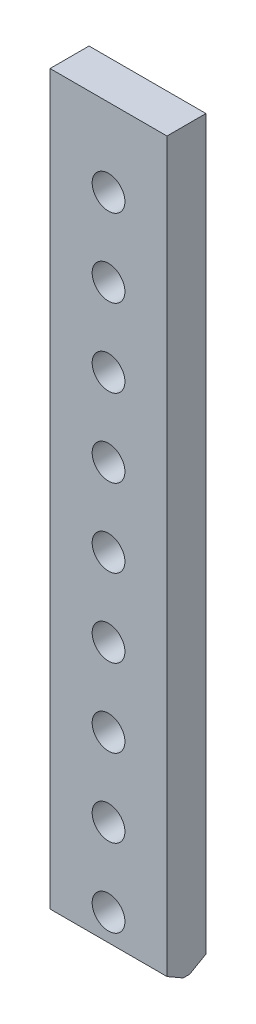
ISO-10303-21;
HEADER;
FILE_DESCRIPTION(('STEP AP214'),'2;1');
FILE_NAME('part.step','',(''),(''),'','','');
FILE_SCHEMA(('AUTOMOTIVE_DESIGN { 1 0 10303 214 1 1 1 1 }'));
ENDSEC;
DATA;
#1=APPLICATION_CONTEXT('core data for automotive mechanical design processes');
#2=APPLICATION_PROTOCOL_DEFINITION('international standard','automotive_design',2000,#1);
#3=PRODUCT_CONTEXT('',#1,'mechanical');
#4=PRODUCT('Part','Part','',(#3));
#5=PRODUCT_RELATED_PRODUCT_CATEGORY('part','',(#4));
#6=PRODUCT_DEFINITION_FORMATION('','',#4);
#7=PRODUCT_DEFINITION_CONTEXT('part definition',#1,'design');
#8=PRODUCT_DEFINITION('design','',#6,#7);
#9=PRODUCT_DEFINITION_SHAPE('','',#8);
#10=(LENGTH_UNIT() NAMED_UNIT(*) SI_UNIT(.MILLI.,.METRE.));
#11=(NAMED_UNIT(*) PLANE_ANGLE_UNIT() SI_UNIT($,.RADIAN.));
#12=(NAMED_UNIT(*) SI_UNIT($,.STERADIAN.) SOLID_ANGLE_UNIT());
#13=UNCERTAINTY_MEASURE_WITH_UNIT(LENGTH_MEASURE(1.E-05),#10,'distance_accuracy_value','');
#14=(GEOMETRIC_REPRESENTATION_CONTEXT(3) GLOBAL_UNCERTAINTY_ASSIGNED_CONTEXT((#13)) GLOBAL_UNIT_ASSIGNED_CONTEXT((#10,
#11,#12)) REPRESENTATION_CONTEXT('',''));
#15=CARTESIAN_POINT('',(0.,0.,0.));
#16=DIRECTION('',(0.,0.,1.));
#17=DIRECTION('',(1.,0.,0.));
#18=AXIS2_PLACEMENT_3D('',#15,#16,#17);
#19=CARTESIAN_POINT('',(0.,0.,25.));
#20=DIRECTION('',(1.,0.,0.));
#21=DIRECTION('',(0.,1.,0.));
#22=AXIS2_PLACEMENT_3D('',#19,#20,#21);
#23=PLANE('',#22);
#24=DIRECTION('',(0.,0.,-1.));
#25=VECTOR('',#24,1.);
#26=CARTESIAN_POINT('',(0.,0.,25.));
#27=LINE('',#26,#25);
#28=CARTESIAN_POINT('',(0.,0.,14.6076951545867));
#29=VERTEX_POINT('',#28);
#30=CARTESIAN_POINT('',(0.,0.,10.3923048454132));
#31=VERTEX_POINT('',#30);
#32=EDGE_CURVE('E120',#29,#31,#27,.T.);
#33=ORIENTED_EDGE('',*,*,#32,.F.);
#34=DIRECTION('',(0.,-0.500000000000002,-0.866025403784437));
#35=VECTOR('',#34,1.);
#36=CARTESIAN_POINT('',(0.,6.00000000000003,25.));
#37=LINE('',#36,#35);
#38=CARTESIAN_POINT('',(0.,6.00000000000003,25.));
#39=VERTEX_POINT('',#38);
#40=EDGE_CURVE('E11',#29,#39,#37,.F.);
#41=ORIENTED_EDGE('',*,*,#40,.T.);
#42=DIRECTION('',(0.,-1.,0.));
#43=VECTOR('',#42,1.);
#44=CARTESIAN_POINT('',(0.,0.,25.));
#45=LINE('',#44,#43);
#46=CARTESIAN_POINT('',(0.,473.,25.));
#47=VERTEX_POINT('',#46);
#48=EDGE_CURVE('E93',#47,#39,#45,.T.);
#49=ORIENTED_EDGE('',*,*,#48,.F.);
#50=DIRECTION('',(0.,0.,-1.));
#51=VECTOR('',#50,1.);
#52=CARTESIAN_POINT('',(0.,473.,25.));
#53=LINE('',#52,#51);
#54=CARTESIAN_POINT('',(0.,473.,0.));
#55=VERTEX_POINT('',#54);
#56=EDGE_CURVE('E103',#47,#55,#53,.T.);
#57=ORIENTED_EDGE('',*,*,#56,.T.);
#58=DIRECTION('',(0.,-1.,0.));
#59=VECTOR('',#58,1.);
#60=CARTESIAN_POINT('',(0.,0.,0.));
#61=LINE('',#60,#59);
#62=CARTESIAN_POINT('',(0.,6.,0.));
#63=VERTEX_POINT('',#62);
#64=EDGE_CURVE('E112',#55,#63,#61,.T.);
#65=ORIENTED_EDGE('',*,*,#64,.T.);
#66=DIRECTION('',(0.,-0.500000000000003,0.866025403784437));
#67=VECTOR('',#66,1.);
#68=CARTESIAN_POINT('',(0.,0.,10.3923048454132));
#69=LINE('',#68,#67);
#70=EDGE_CURVE('E129',#63,#31,#69,.T.);
#71=ORIENTED_EDGE('',*,*,#70,.T.);
#72=EDGE_LOOP('',(#33,#41,#49,#57,#65,#71));
#73=FACE_BOUND('',#72,.T.);
#74=ADVANCED_FACE('F34',(#73),#23,.F.);
#75=CARTESIAN_POINT('',(0.,0.,25.));
#76=DIRECTION('',(0.,1.,0.));
#77=DIRECTION('',(-1.,0.,0.));
#78=AXIS2_PLACEMENT_3D('',#75,#76,#77);
#79=PLANE('',#78);
#80=DIRECTION('',(0.,0.,-1.));
#81=VECTOR('',#80,1.);
#82=CARTESIAN_POINT('',(75.0000000000001,0.,25.));
#83=LINE('',#82,#81);
#84=CARTESIAN_POINT('',(75.0000000000001,0.,14.6076951545867));
#85=VERTEX_POINT('',#84);
#86=CARTESIAN_POINT('',(75.0000000000001,0.,10.3923048454132));
#87=VERTEX_POINT('',#86);
#88=EDGE_CURVE('E102',#85,#87,#83,.T.);
#89=ORIENTED_EDGE('',*,*,#88,.F.);
#90=DIRECTION('',(-1.,0.,0.));
#91=VECTOR('',#90,1.);
#92=CARTESIAN_POINT('',(0.,0.,14.6076951545867));
#93=LINE('',#92,#91);
#94=EDGE_CURVE('E42',#85,#29,#93,.T.);
#95=ORIENTED_EDGE('',*,*,#94,.T.);
#96=ORIENTED_EDGE('',*,*,#32,.T.);
#97=DIRECTION('',(1.,0.,0.));
#98=VECTOR('',#97,1.);
#99=CARTESIAN_POINT('',(75.0000000000001,0.,10.3923048454132));
#100=LINE('',#99,#98);
#101=EDGE_CURVE('E122',#31,#87,#100,.T.);
#102=ORIENTED_EDGE('',*,*,#101,.T.);
#103=EDGE_LOOP('',(#89,#95,#96,#102));
#104=FACE_BOUND('',#103,.T.);
#105=ADVANCED_FACE('F142',(#104),#79,.F.);
#106=CARTESIAN_POINT('',(75.0000000000001,0.,25.));
#107=DIRECTION('',(-1.,0.,0.));
#108=DIRECTION('',(0.,-1.,0.));
#109=AXIS2_PLACEMENT_3D('',#106,#107,#108);
#110=PLANE('',#109);
#111=DIRECTION('',(0.,1.,0.));
#112=VECTOR('',#111,1.);
#113=CARTESIAN_POINT('',(75.0000000000001,0.,25.));
#114=LINE('',#113,#112);
#115=CARTESIAN_POINT('',(75.0000000000001,6.00000000000005,25.));
#116=VERTEX_POINT('',#115);
#117=CARTESIAN_POINT('',(75.,473.,25.));
#118=VERTEX_POINT('',#117);
#119=EDGE_CURVE('E84',#116,#118,#114,.T.);
#120=ORIENTED_EDGE('',*,*,#119,.F.);
#121=DIRECTION('',(0.,0.500000000000002,0.866025403784437));
#122=VECTOR('',#121,1.);
#123=CARTESIAN_POINT('',(75.0000000000001,6.00000000000005,25.));
#124=LINE('',#123,#122);
#125=EDGE_CURVE('E56',#116,#85,#124,.F.);
#126=ORIENTED_EDGE('',*,*,#125,.T.);
#127=ORIENTED_EDGE('',*,*,#88,.T.);
#128=DIRECTION('',(0.,0.500000000000003,-0.866025403784437));
#129=VECTOR('',#128,1.);
#130=CARTESIAN_POINT('',(75.0000000000001,0.,10.3923048454132));
#131=LINE('',#130,#129);
#132=CARTESIAN_POINT('',(75.0000000000001,6.00000000000002,0.));
#133=VERTEX_POINT('',#132);
#134=EDGE_CURVE('E125',#87,#133,#131,.T.);
#135=ORIENTED_EDGE('',*,*,#134,.T.);
#136=DIRECTION('',(0.,1.,0.));
#137=VECTOR('',#136,1.);
#138=CARTESIAN_POINT('',(75.0000000000001,0.,0.));
#139=LINE('',#138,#137);
#140=CARTESIAN_POINT('',(75.,473.,0.));
#141=VERTEX_POINT('',#140);
#142=EDGE_CURVE('E99',#133,#141,#139,.T.);
#143=ORIENTED_EDGE('',*,*,#142,.T.);
#144=DIRECTION('',(0.,0.,-1.));
#145=VECTOR('',#144,1.);
#146=CARTESIAN_POINT('',(75.,473.,25.));
#147=LINE('',#146,#145);
#148=EDGE_CURVE('E96',#118,#141,#147,.T.);
#149=ORIENTED_EDGE('',*,*,#148,.F.);
#150=EDGE_LOOP('',(#120,#126,#127,#135,#143,#149));
#151=FACE_BOUND('',#150,.T.);
#152=ADVANCED_FACE('F97',(#151),#110,.F.);
#153=CARTESIAN_POINT('',(0.,473.,25.));
#154=DIRECTION('',(0.,-1.,0.));
#155=DIRECTION('',(0.,0.,-1.));
#156=AXIS2_PLACEMENT_3D('',#153,#154,#155);
#157=PLANE('',#156);
#158=DIRECTION('',(-1.,0.,0.));
#159=VECTOR('',#158,1.);
#160=CARTESIAN_POINT('',(0.,473.,0.));
#161=LINE('',#160,#159);
#162=EDGE_CURVE('E117',#141,#55,#161,.T.);
#163=ORIENTED_EDGE('',*,*,#162,.T.);
#164=ORIENTED_EDGE('',*,*,#56,.F.);
#165=DIRECTION('',(-1.,0.,0.));
#166=VECTOR('',#165,1.);
#167=CARTESIAN_POINT('',(0.,473.,25.));
#168=LINE('',#167,#166);
#169=EDGE_CURVE('E89',#118,#47,#168,.T.);
#170=ORIENTED_EDGE('',*,*,#169,.F.);
#171=ORIENTED_EDGE('',*,*,#148,.T.);
#172=EDGE_LOOP('',(#163,#164,#170,#171));
#173=FACE_BOUND('',#172,.T.);
#174=ADVANCED_FACE('F105',(#173),#157,.F.);
#175=CARTESIAN_POINT('',(0.,0.,25.));
#176=DIRECTION('',(0.,0.,-1.));
#177=DIRECTION('',(-1.,0.,0.));
#178=AXIS2_PLACEMENT_3D('',#175,#176,#177);
#179=PLANE('',#178);
#180=CARTESIAN_POINT('',(37.5000000000001,73.,25.));
#181=DIRECTION('',(0.,0.,1.));
#182=DIRECTION('',(1.,0.,0.));
#183=AXIS2_PLACEMENT_3D('',#180,#181,#182);
#184=CIRCLE('',#183,10.5);
#185=CARTESIAN_POINT('',(48.0000000000001,73.,25.));
#186=VERTEX_POINT('',#185);
#187=EDGE_CURVE('E193',#186,#186,#184,.T.);
#188=ORIENTED_EDGE('',*,*,#187,.F.);
#189=EDGE_LOOP('',(#188));
#190=FACE_BOUND('',#189,.T.);
#191=CARTESIAN_POINT('',(37.5000000000001,123.,25.));
#192=DIRECTION('',(0.,0.,1.));
#193=DIRECTION('',(1.,0.,0.));
#194=AXIS2_PLACEMENT_3D('',#191,#192,#193);
#195=CIRCLE('',#194,10.5);
#196=CARTESIAN_POINT('',(48.0000000000001,123.,25.));
#197=VERTEX_POINT('',#196);
#198=EDGE_CURVE('E187',#197,#197,#195,.T.);
#199=ORIENTED_EDGE('',*,*,#198,.F.);
#200=EDGE_LOOP('',(#199));
#201=FACE_BOUND('',#200,.T.);
#202=CARTESIAN_POINT('',(37.5000000000001,173.,25.));
#203=DIRECTION('',(0.,0.,1.));
#204=DIRECTION('',(1.,0.,0.));
#205=AXIS2_PLACEMENT_3D('',#202,#203,#204);
#206=CIRCLE('',#205,10.5);
#207=CARTESIAN_POINT('',(48.0000000000001,173.,25.));
#208=VERTEX_POINT('',#207);
#209=EDGE_CURVE('E181',#208,#208,#206,.T.);
#210=ORIENTED_EDGE('',*,*,#209,.F.);
#211=EDGE_LOOP('',(#210));
#212=FACE_BOUND('',#211,.T.);
#213=CARTESIAN_POINT('',(37.5000000000001,223.,25.));
#214=DIRECTION('',(0.,0.,1.));
#215=DIRECTION('',(1.,0.,0.));
#216=AXIS2_PLACEMENT_3D('',#213,#214,#215);
#217=CIRCLE('',#216,10.5);
#218=CARTESIAN_POINT('',(48.0000000000001,223.,25.));
#219=VERTEX_POINT('',#218);
#220=EDGE_CURVE('E175',#219,#219,#217,.T.);
#221=ORIENTED_EDGE('',*,*,#220,.F.);
#222=EDGE_LOOP('',(#221));
#223=FACE_BOUND('',#222,.T.);
#224=CARTESIAN_POINT('',(37.5000000000001,273.,25.));
#225=DIRECTION('',(0.,0.,1.));
#226=DIRECTION('',(1.,0.,0.));
#227=AXIS2_PLACEMENT_3D('',#224,#225,#226);
#228=CIRCLE('',#227,10.5);
#229=CARTESIAN_POINT('',(48.0000000000001,273.,25.));
#230=VERTEX_POINT('',#229);
#231=EDGE_CURVE('E169',#230,#230,#228,.T.);
#232=ORIENTED_EDGE('',*,*,#231,.F.);
#233=EDGE_LOOP('',(#232));
#234=FACE_BOUND('',#233,.T.);
#235=CARTESIAN_POINT('',(37.5000000000001,323.,25.));
#236=DIRECTION('',(0.,0.,1.));
#237=DIRECTION('',(1.,0.,0.));
#238=AXIS2_PLACEMENT_3D('',#235,#236,#237);
#239=CIRCLE('',#238,10.5);
#240=CARTESIAN_POINT('',(48.0000000000001,323.,25.));
#241=VERTEX_POINT('',#240);
#242=EDGE_CURVE('E163',#241,#241,#239,.T.);
#243=ORIENTED_EDGE('',*,*,#242,.F.);
#244=EDGE_LOOP('',(#243));
#245=FACE_BOUND('',#244,.T.);
#246=CARTESIAN_POINT('',(37.5000000000001,373.,25.));
#247=DIRECTION('',(0.,0.,1.));
#248=DIRECTION('',(1.,0.,0.));
#249=AXIS2_PLACEMENT_3D('',#246,#247,#248);
#250=CIRCLE('',#249,10.5);
#251=CARTESIAN_POINT('',(48.0000000000001,373.,25.));
#252=VERTEX_POINT('',#251);
#253=EDGE_CURVE('E157',#252,#252,#250,.T.);
#254=ORIENTED_EDGE('',*,*,#253,.F.);
#255=EDGE_LOOP('',(#254));
#256=FACE_BOUND('',#255,.T.);
#257=CARTESIAN_POINT('',(37.5000000000001,423.,25.));
#258=DIRECTION('',(0.,0.,1.));
#259=DIRECTION('',(1.,0.,0.));
#260=AXIS2_PLACEMENT_3D('',#257,#258,#259);
#261=CIRCLE('',#260,10.5);
#262=CARTESIAN_POINT('',(48.0000000000001,423.,25.));
#263=VERTEX_POINT('',#262);
#264=EDGE_CURVE('E151',#263,#263,#261,.T.);
#265=ORIENTED_EDGE('',*,*,#264,.F.);
#266=EDGE_LOOP('',(#265));
#267=FACE_BOUND('',#266,.T.);
#268=CARTESIAN_POINT('',(37.5000000000001,23.,25.));
#269=DIRECTION('',(0.,0.,1.));
#270=DIRECTION('',(1.,0.,0.));
#271=AXIS2_PLACEMENT_3D('',#268,#269,#270);
#272=CIRCLE('',#271,10.5);
#273=CARTESIAN_POINT('',(48.0000000000001,23.,25.));
#274=VERTEX_POINT('',#273);
#275=EDGE_CURVE('E145',#274,#274,#272,.T.);
#276=ORIENTED_EDGE('',*,*,#275,.F.);
#277=EDGE_LOOP('',(#276));
#278=FACE_BOUND('',#277,.T.);
#279=ORIENTED_EDGE('',*,*,#48,.T.);
#280=DIRECTION('',(1.,0.,0.));
#281=VECTOR('',#280,1.);
#282=CARTESIAN_POINT('',(0.,6.00000000000003,25.));
#283=LINE('',#282,#281);
#284=EDGE_CURVE('E92',#39,#116,#283,.T.);
#285=ORIENTED_EDGE('',*,*,#284,.T.);
#286=ORIENTED_EDGE('',*,*,#119,.T.);
#287=ORIENTED_EDGE('',*,*,#169,.T.);
#288=EDGE_LOOP('',(#279,#285,#286,#287));
#289=FACE_BOUND('',#288,.T.);
#290=ADVANCED_FACE('F87',(#190,#201,#212,#223,#234,#245,#256,#267,#278,#289),#179,.F.);
#291=CARTESIAN_POINT('',(0.,0.,0.));
#292=DIRECTION('',(0.,0.,-1.));
#293=DIRECTION('',(-1.,0.,0.));
#294=AXIS2_PLACEMENT_3D('',#291,#292,#293);
#295=PLANE('',#294);
#296=CARTESIAN_POINT('',(37.5000000000001,73.,0.));
#297=DIRECTION('',(0.,0.,1.));
#298=DIRECTION('',(1.,0.,0.));
#299=AXIS2_PLACEMENT_3D('',#296,#297,#298);
#300=CIRCLE('',#299,10.5);
#301=CARTESIAN_POINT('',(48.0000000000001,73.,0.));
#302=VERTEX_POINT('',#301);
#303=EDGE_CURVE('E148',#302,#302,#300,.T.);
#304=ORIENTED_EDGE('',*,*,#303,.T.);
#305=EDGE_LOOP('',(#304));
#306=FACE_BOUND('',#305,.T.);
#307=CARTESIAN_POINT('',(37.5000000000001,123.,0.));
#308=DIRECTION('',(0.,0.,1.));
#309=DIRECTION('',(1.,0.,0.));
#310=AXIS2_PLACEMENT_3D('',#307,#308,#309);
#311=CIRCLE('',#310,10.5);
#312=CARTESIAN_POINT('',(48.0000000000001,123.,0.));
#313=VERTEX_POINT('',#312);
#314=EDGE_CURVE('E190',#313,#313,#311,.T.);
#315=ORIENTED_EDGE('',*,*,#314,.T.);
#316=EDGE_LOOP('',(#315));
#317=FACE_BOUND('',#316,.T.);
#318=CARTESIAN_POINT('',(37.5000000000001,173.,0.));
#319=DIRECTION('',(0.,0.,1.));
#320=DIRECTION('',(1.,0.,0.));
#321=AXIS2_PLACEMENT_3D('',#318,#319,#320);
#322=CIRCLE('',#321,10.5);
#323=CARTESIAN_POINT('',(48.0000000000001,173.,0.));
#324=VERTEX_POINT('',#323);
#325=EDGE_CURVE('E184',#324,#324,#322,.T.);
#326=ORIENTED_EDGE('',*,*,#325,.T.);
#327=EDGE_LOOP('',(#326));
#328=FACE_BOUND('',#327,.T.);
#329=CARTESIAN_POINT('',(37.5000000000001,223.,0.));
#330=DIRECTION('',(0.,0.,1.));
#331=DIRECTION('',(1.,0.,0.));
#332=AXIS2_PLACEMENT_3D('',#329,#330,#331);
#333=CIRCLE('',#332,10.5);
#334=CARTESIAN_POINT('',(48.0000000000001,223.,0.));
#335=VERTEX_POINT('',#334);
#336=EDGE_CURVE('E178',#335,#335,#333,.T.);
#337=ORIENTED_EDGE('',*,*,#336,.T.);
#338=EDGE_LOOP('',(#337));
#339=FACE_BOUND('',#338,.T.);
#340=CARTESIAN_POINT('',(37.5000000000001,273.,0.));
#341=DIRECTION('',(0.,0.,1.));
#342=DIRECTION('',(1.,0.,0.));
#343=AXIS2_PLACEMENT_3D('',#340,#341,#342);
#344=CIRCLE('',#343,10.5);
#345=CARTESIAN_POINT('',(48.0000000000001,273.,0.));
#346=VERTEX_POINT('',#345);
#347=EDGE_CURVE('E172',#346,#346,#344,.T.);
#348=ORIENTED_EDGE('',*,*,#347,.T.);
#349=EDGE_LOOP('',(#348));
#350=FACE_BOUND('',#349,.T.);
#351=CARTESIAN_POINT('',(37.5000000000001,323.,0.));
#352=DIRECTION('',(0.,0.,1.));
#353=DIRECTION('',(1.,0.,0.));
#354=AXIS2_PLACEMENT_3D('',#351,#352,#353);
#355=CIRCLE('',#354,10.5);
#356=CARTESIAN_POINT('',(48.0000000000001,323.,0.));
#357=VERTEX_POINT('',#356);
#358=EDGE_CURVE('E166',#357,#357,#355,.T.);
#359=ORIENTED_EDGE('',*,*,#358,.T.);
#360=EDGE_LOOP('',(#359));
#361=FACE_BOUND('',#360,.T.);
#362=CARTESIAN_POINT('',(37.5000000000001,373.,0.));
#363=DIRECTION('',(0.,0.,1.));
#364=DIRECTION('',(1.,0.,0.));
#365=AXIS2_PLACEMENT_3D('',#362,#363,#364);
#366=CIRCLE('',#365,10.5);
#367=CARTESIAN_POINT('',(48.0000000000001,373.,0.));
#368=VERTEX_POINT('',#367);
#369=EDGE_CURVE('E160',#368,#368,#366,.T.);
#370=ORIENTED_EDGE('',*,*,#369,.T.);
#371=EDGE_LOOP('',(#370));
#372=FACE_BOUND('',#371,.T.);
#373=CARTESIAN_POINT('',(37.5000000000001,423.,0.));
#374=DIRECTION('',(0.,0.,1.));
#375=DIRECTION('',(1.,0.,0.));
#376=AXIS2_PLACEMENT_3D('',#373,#374,#375);
#377=CIRCLE('',#376,10.5);
#378=CARTESIAN_POINT('',(48.0000000000001,423.,0.));
#379=VERTEX_POINT('',#378);
#380=EDGE_CURVE('E154',#379,#379,#377,.T.);
#381=ORIENTED_EDGE('',*,*,#380,.T.);
#382=EDGE_LOOP('',(#381));
#383=FACE_BOUND('',#382,.T.);
#384=CARTESIAN_POINT('',(37.5000000000001,23.,0.));
#385=DIRECTION('',(0.,0.,1.));
#386=DIRECTION('',(1.,0.,0.));
#387=AXIS2_PLACEMENT_3D('',#384,#385,#386);
#388=CIRCLE('',#387,10.5);
#389=CARTESIAN_POINT('',(48.0000000000001,23.,0.));
#390=VERTEX_POINT('',#389);
#391=EDGE_CURVE('E115',#390,#390,#388,.T.);
#392=ORIENTED_EDGE('',*,*,#391,.T.);
#393=EDGE_LOOP('',(#392));
#394=FACE_BOUND('',#393,.T.);
#395=ORIENTED_EDGE('',*,*,#142,.F.);
#396=DIRECTION('',(-1.,0.,0.));
#397=VECTOR('',#396,1.);
#398=CARTESIAN_POINT('',(0.,6.00000000000001,0.));
#399=LINE('',#398,#397);
#400=EDGE_CURVE('E127',#133,#63,#399,.T.);
#401=ORIENTED_EDGE('',*,*,#400,.T.);
#402=ORIENTED_EDGE('',*,*,#64,.F.);
#403=ORIENTED_EDGE('',*,*,#162,.F.);
#404=EDGE_LOOP('',(#395,#401,#402,#403));
#405=FACE_BOUND('',#404,.T.);
#406=ADVANCED_FACE('F199',(#306,#317,#328,#339,#350,#361,#372,#383,#394,#405),#295,.T.);
#407=CARTESIAN_POINT('',(37.5000000000001,23.,0.));
#408=DIRECTION('',(0.,0.,1.));
#409=DIRECTION('',(1.,0.,0.));
#410=AXIS2_PLACEMENT_3D('',#407,#408,#409);
#411=CYLINDRICAL_SURFACE('',#410,10.5);
#412=ORIENTED_EDGE('',*,*,#391,.F.);
#413=EDGE_LOOP('',(#412));
#414=FACE_BOUND('',#413,.T.);
#415=ORIENTED_EDGE('',*,*,#275,.T.);
#416=EDGE_LOOP('',(#415));
#417=FACE_BOUND('',#416,.T.);
#418=ADVANCED_FACE('F228',(#414,#417),#411,.F.);
#419=CARTESIAN_POINT('',(37.5000000000001,423.,0.));
#420=DIRECTION('',(0.,0.,1.));
#421=DIRECTION('',(1.,0.,0.));
#422=AXIS2_PLACEMENT_3D('',#419,#420,#421);
#423=CYLINDRICAL_SURFACE('',#422,10.5);
#424=ORIENTED_EDGE('',*,*,#380,.F.);
#425=EDGE_LOOP('',(#424));
#426=FACE_BOUND('',#425,.T.);
#427=ORIENTED_EDGE('',*,*,#264,.T.);
#428=EDGE_LOOP('',(#427));
#429=FACE_BOUND('',#428,.T.);
#430=ADVANCED_FACE('F230',(#426,#429),#423,.F.);
#431=CARTESIAN_POINT('',(37.5000000000001,373.,0.));
#432=DIRECTION('',(0.,0.,1.));
#433=DIRECTION('',(1.,0.,0.));
#434=AXIS2_PLACEMENT_3D('',#431,#432,#433);
#435=CYLINDRICAL_SURFACE('',#434,10.5);
#436=ORIENTED_EDGE('',*,*,#369,.F.);
#437=EDGE_LOOP('',(#436));
#438=FACE_BOUND('',#437,.T.);
#439=ORIENTED_EDGE('',*,*,#253,.T.);
#440=EDGE_LOOP('',(#439));
#441=FACE_BOUND('',#440,.T.);
#442=ADVANCED_FACE('F237',(#438,#441),#435,.F.);
#443=CARTESIAN_POINT('',(37.5000000000001,323.,0.));
#444=DIRECTION('',(0.,0.,1.));
#445=DIRECTION('',(1.,0.,0.));
#446=AXIS2_PLACEMENT_3D('',#443,#444,#445);
#447=CYLINDRICAL_SURFACE('',#446,10.5);
#448=ORIENTED_EDGE('',*,*,#358,.F.);
#449=EDGE_LOOP('',(#448));
#450=FACE_BOUND('',#449,.T.);
#451=ORIENTED_EDGE('',*,*,#242,.T.);
#452=EDGE_LOOP('',(#451));
#453=FACE_BOUND('',#452,.T.);
#454=ADVANCED_FACE('F336',(#450,#453),#447,.F.);
#455=CARTESIAN_POINT('',(37.5000000000001,273.,0.));
#456=DIRECTION('',(0.,0.,1.));
#457=DIRECTION('',(1.,0.,0.));
#458=AXIS2_PLACEMENT_3D('',#455,#456,#457);
#459=CYLINDRICAL_SURFACE('',#458,10.5);
#460=ORIENTED_EDGE('',*,*,#347,.F.);
#461=EDGE_LOOP('',(#460));
#462=FACE_BOUND('',#461,.T.);
#463=ORIENTED_EDGE('',*,*,#231,.T.);
#464=EDGE_LOOP('',(#463));
#465=FACE_BOUND('',#464,.T.);
#466=ADVANCED_FACE('F326',(#462,#465),#459,.F.);
#467=CARTESIAN_POINT('',(37.5000000000001,223.,0.));
#468=DIRECTION('',(0.,0.,1.));
#469=DIRECTION('',(1.,0.,0.));
#470=AXIS2_PLACEMENT_3D('',#467,#468,#469);
#471=CYLINDRICAL_SURFACE('',#470,10.5);
#472=ORIENTED_EDGE('',*,*,#336,.F.);
#473=EDGE_LOOP('',(#472));
#474=FACE_BOUND('',#473,.T.);
#475=ORIENTED_EDGE('',*,*,#220,.T.);
#476=EDGE_LOOP('',(#475));
#477=FACE_BOUND('',#476,.T.);
#478=ADVANCED_FACE('F316',(#474,#477),#471,.F.);
#479=CARTESIAN_POINT('',(37.5000000000001,173.,0.));
#480=DIRECTION('',(0.,0.,1.));
#481=DIRECTION('',(1.,0.,0.));
#482=AXIS2_PLACEMENT_3D('',#479,#480,#481);
#483=CYLINDRICAL_SURFACE('',#482,10.5);
#484=ORIENTED_EDGE('',*,*,#325,.F.);
#485=EDGE_LOOP('',(#484));
#486=FACE_BOUND('',#485,.T.);
#487=ORIENTED_EDGE('',*,*,#209,.T.);
#488=EDGE_LOOP('',(#487));
#489=FACE_BOUND('',#488,.T.);
#490=ADVANCED_FACE('F306',(#486,#489),#483,.F.);
#491=CARTESIAN_POINT('',(37.5000000000001,123.,0.));
#492=DIRECTION('',(0.,0.,1.));
#493=DIRECTION('',(1.,0.,0.));
#494=AXIS2_PLACEMENT_3D('',#491,#492,#493);
#495=CYLINDRICAL_SURFACE('',#494,10.5);
#496=ORIENTED_EDGE('',*,*,#314,.F.);
#497=EDGE_LOOP('',(#496));
#498=FACE_BOUND('',#497,.T.);
#499=ORIENTED_EDGE('',*,*,#198,.T.);
#500=EDGE_LOOP('',(#499));
#501=FACE_BOUND('',#500,.T.);
#502=ADVANCED_FACE('F205',(#498,#501),#495,.F.);
#503=CARTESIAN_POINT('',(37.5000000000001,73.,0.));
#504=DIRECTION('',(0.,0.,1.));
#505=DIRECTION('',(1.,0.,0.));
#506=AXIS2_PLACEMENT_3D('',#503,#504,#505);
#507=CYLINDRICAL_SURFACE('',#506,10.5);
#508=ORIENTED_EDGE('',*,*,#303,.F.);
#509=EDGE_LOOP('',(#508));
#510=FACE_BOUND('',#509,.T.);
#511=ORIENTED_EDGE('',*,*,#187,.T.);
#512=EDGE_LOOP('',(#511));
#513=FACE_BOUND('',#512,.T.);
#514=ADVANCED_FACE('F202',(#510,#513),#507,.F.);
#515=CARTESIAN_POINT('',(0.,0.,10.3923048454132));
#516=DIRECTION('',(0.,-0.866025403784437,-0.500000000000003));
#517=DIRECTION('',(-1.,0.,0.));
#518=AXIS2_PLACEMENT_3D('',#515,#516,#517);
#519=PLANE('',#518);
#520=ORIENTED_EDGE('',*,*,#70,.F.);
#521=ORIENTED_EDGE('',*,*,#400,.F.);
#522=ORIENTED_EDGE('',*,*,#134,.F.);
#523=ORIENTED_EDGE('',*,*,#101,.F.);
#524=EDGE_LOOP('',(#520,#521,#522,#523));
#525=FACE_BOUND('',#524,.T.);
#526=ADVANCED_FACE('F141',(#525),#519,.T.);
#527=CARTESIAN_POINT('',(0.,6.00000000000003,25.));
#528=DIRECTION('',(0.,0.866025403784437,-0.500000000000002));
#529=DIRECTION('',(1.,0.,0.));
#530=AXIS2_PLACEMENT_3D('',#527,#528,#529);
#531=PLANE('',#530);
#532=ORIENTED_EDGE('',*,*,#40,.F.);
#533=ORIENTED_EDGE('',*,*,#94,.F.);
#534=ORIENTED_EDGE('',*,*,#125,.F.);
#535=ORIENTED_EDGE('',*,*,#284,.F.);
#536=EDGE_LOOP('',(#532,#533,#534,#535));
#537=FACE_BOUND('',#536,.T.);
#538=ADVANCED_FACE('F36',(#537),#531,.F.);
#539=CLOSED_SHELL('',(#74,#105,#152,#174,#290,#406,#418,#430,#442,#454,#466,#478,#490,#502,#514,
#526,#538));
#540=MANIFOLD_SOLID_BREP('B2',#539);
#541=ADVANCED_BREP_SHAPE_REPRESENTATION('',(#18,#540),#14);
#542=SHAPE_DEFINITION_REPRESENTATION(#9,#541);
ENDSEC;
END-ISO-10303-21;
